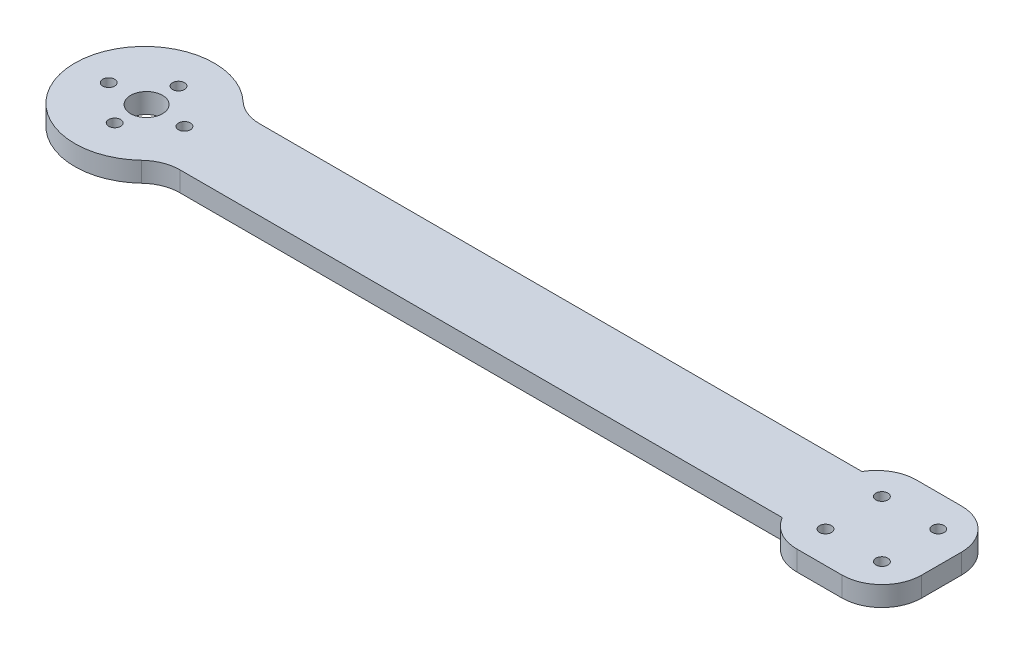
ISO-10303-21;
HEADER;
FILE_DESCRIPTION(('STEP AP214'),'2;1');
FILE_NAME('part.step','',(''),(''),'','','');
FILE_SCHEMA(('AUTOMOTIVE_DESIGN { 1 0 10303 214 1 1 1 1 }'));
ENDSEC;
DATA;
#1=APPLICATION_CONTEXT('core data for automotive mechanical design processes');
#2=APPLICATION_PROTOCOL_DEFINITION('international standard','automotive_design',2000,#1);
#3=PRODUCT_CONTEXT('',#1,'mechanical');
#4=PRODUCT('Part','Part','',(#3));
#5=PRODUCT_RELATED_PRODUCT_CATEGORY('part','',(#4));
#6=PRODUCT_DEFINITION_FORMATION('','',#4);
#7=PRODUCT_DEFINITION_CONTEXT('part definition',#1,'design');
#8=PRODUCT_DEFINITION('design','',#6,#7);
#9=PRODUCT_DEFINITION_SHAPE('','',#8);
#10=(LENGTH_UNIT() NAMED_UNIT(*) SI_UNIT(.MILLI.,.METRE.));
#11=(NAMED_UNIT(*) PLANE_ANGLE_UNIT() SI_UNIT($,.RADIAN.));
#12=(NAMED_UNIT(*) SI_UNIT($,.STERADIAN.) SOLID_ANGLE_UNIT());
#13=UNCERTAINTY_MEASURE_WITH_UNIT(LENGTH_MEASURE(1.E-05),#10,'distance_accuracy_value','');
#14=(GEOMETRIC_REPRESENTATION_CONTEXT(3) GLOBAL_UNCERTAINTY_ASSIGNED_CONTEXT((#13)) GLOBAL_UNIT_ASSIGNED_CONTEXT((#10,
#11,#12)) REPRESENTATION_CONTEXT('',''));
#15=CARTESIAN_POINT('',(0.,0.,0.));
#16=DIRECTION('',(0.,0.,1.));
#17=DIRECTION('',(1.,0.,0.));
#18=AXIS2_PLACEMENT_3D('',#15,#16,#17);
#19=CARTESIAN_POINT('',(-100.,5.,0.));
#20=DIRECTION('',(0.,-1.,0.));
#21=DIRECTION('',(0.,0.,-1.));
#22=AXIS2_PLACEMENT_3D('',#19,#20,#21);
#23=CYLINDRICAL_SURFACE('',#22,17.5);
#24=CARTESIAN_POINT('',(-100.,5.,0.));
#25=DIRECTION('',(0.,1.,0.));
#26=DIRECTION('',(0.,0.,1.));
#27=AXIS2_PLACEMENT_3D('',#24,#25,#26);
#28=CIRCLE('',#27,17.5);
#29=CARTESIAN_POINT('',(-87.9888997620693,5.,-12.7272727272727));
#30=VERTEX_POINT('',#29);
#31=CARTESIAN_POINT('',(-87.9888997620693,5.,12.7272727272727));
#32=VERTEX_POINT('',#31);
#33=EDGE_CURVE('E132',#30,#32,#28,.T.);
#34=ORIENTED_EDGE('',*,*,#33,.F.);
#35=DIRECTION('',(0.,-1.,0.));
#36=VECTOR('',#35,1.);
#37=CARTESIAN_POINT('',(-87.9888997620693,5.,-12.7272727272727));
#38=LINE('',#37,#36);
#39=CARTESIAN_POINT('',(-87.9888997620693,0.,-12.7272727272727));
#40=VERTEX_POINT('',#39);
#41=EDGE_CURVE('E166',#30,#40,#38,.T.);
#42=ORIENTED_EDGE('',*,*,#41,.T.);
#43=CARTESIAN_POINT('',(-100.,0.,0.));
#44=DIRECTION('',(0.,1.,0.));
#45=DIRECTION('',(0.,0.,1.));
#46=AXIS2_PLACEMENT_3D('',#43,#44,#45);
#47=CIRCLE('',#46,17.5);
#48=CARTESIAN_POINT('',(-87.9888997620693,0.,12.7272727272727));
#49=VERTEX_POINT('',#48);
#50=EDGE_CURVE('E181',#40,#49,#47,.T.);
#51=ORIENTED_EDGE('',*,*,#50,.T.);
#52=DIRECTION('',(0.,-1.,0.));
#53=VECTOR('',#52,1.);
#54=CARTESIAN_POINT('',(-87.9888997620693,5.,12.7272727272727));
#55=LINE('',#54,#53);
#56=EDGE_CURVE('E164',#49,#32,#55,.F.);
#57=ORIENTED_EDGE('',*,*,#56,.T.);
#58=EDGE_LOOP('',(#34,#42,#51,#57));
#59=FACE_BOUND('',#58,.T.);
#60=ADVANCED_FACE('F38',(#59),#23,.T.);
#61=CARTESIAN_POINT('',(0.,5.,10.));
#62=DIRECTION('',(0.,0.,-1.));
#63=DIRECTION('',(-1.,0.,0.));
#64=AXIS2_PLACEMENT_3D('',#61,#62,#63);
#65=PLANE('',#64);
#66=DIRECTION('',(1.,0.,0.));
#67=VECTOR('',#66,1.);
#68=CARTESIAN_POINT('',(0.,5.,10.));
#69=LINE('',#68,#67);
#70=CARTESIAN_POINT('',(-81.1254139118231,5.,10.));
#71=VERTEX_POINT('',#70);
#72=CARTESIAN_POINT('',(70.,5.,10.));
#73=VERTEX_POINT('',#72);
#74=EDGE_CURVE('E123',#71,#73,#69,.T.);
#75=ORIENTED_EDGE('',*,*,#74,.F.);
#76=DIRECTION('',(0.,1.,0.));
#77=VECTOR('',#76,1.);
#78=CARTESIAN_POINT('',(-81.1254139118231,0.,10.));
#79=LINE('',#78,#77);
#80=CARTESIAN_POINT('',(-81.1254139118231,0.,10.));
#81=VERTEX_POINT('',#80);
#82=EDGE_CURVE('E171',#71,#81,#79,.F.);
#83=ORIENTED_EDGE('',*,*,#82,.T.);
#84=DIRECTION('',(1.,0.,0.));
#85=VECTOR('',#84,1.);
#86=CARTESIAN_POINT('',(0.,0.,10.));
#87=LINE('',#86,#85);
#88=CARTESIAN_POINT('',(70.,0.,10.));
#89=VERTEX_POINT('',#88);
#90=EDGE_CURVE('E138',#81,#89,#87,.T.);
#91=ORIENTED_EDGE('',*,*,#90,.T.);
#92=DIRECTION('',(0.,-1.,0.));
#93=VECTOR('',#92,1.);
#94=CARTESIAN_POINT('',(70.,5.,10.));
#95=LINE('',#94,#93);
#96=EDGE_CURVE('E135',#73,#89,#95,.T.);
#97=ORIENTED_EDGE('',*,*,#96,.F.);
#98=EDGE_LOOP('',(#75,#83,#91,#97));
#99=FACE_BOUND('',#98,.T.);
#100=ADVANCED_FACE('F136',(#99),#65,.F.);
#101=CARTESIAN_POINT('',(0.,5.,15.));
#102=DIRECTION('',(0.,0.,-1.));
#103=DIRECTION('',(-1.,0.,0.));
#104=AXIS2_PLACEMENT_3D('',#101,#102,#103);
#105=PLANE('',#104);
#106=DIRECTION('',(1.,0.,0.));
#107=VECTOR('',#106,1.);
#108=CARTESIAN_POINT('',(0.,5.,15.));
#109=LINE('',#108,#107);
#110=CARTESIAN_POINT('',(78.6602540378444,5.,15.));
#111=VERTEX_POINT('',#110);
#112=CARTESIAN_POINT('',(90.,5.,15.));
#113=VERTEX_POINT('',#112);
#114=EDGE_CURVE('E131',#111,#113,#109,.T.);
#115=ORIENTED_EDGE('',*,*,#114,.F.);
#116=DIRECTION('',(0.,1.,0.));
#117=VECTOR('',#116,1.);
#118=CARTESIAN_POINT('',(78.6602540378444,5.,15.));
#119=LINE('',#118,#117);
#120=CARTESIAN_POINT('',(78.6602540378444,0.,15.));
#121=VERTEX_POINT('',#120);
#122=EDGE_CURVE('E147',#111,#121,#119,.F.);
#123=ORIENTED_EDGE('',*,*,#122,.T.);
#124=DIRECTION('',(1.,0.,0.));
#125=VECTOR('',#124,1.);
#126=CARTESIAN_POINT('',(0.,0.,15.));
#127=LINE('',#126,#125);
#128=CARTESIAN_POINT('',(90.,0.,15.));
#129=VERTEX_POINT('',#128);
#130=EDGE_CURVE('E249',#121,#129,#127,.T.);
#131=ORIENTED_EDGE('',*,*,#130,.T.);
#132=DIRECTION('',(0.,-1.,0.));
#133=VECTOR('',#132,1.);
#134=CARTESIAN_POINT('',(90.,5.,15.));
#135=LINE('',#134,#133);
#136=EDGE_CURVE('E141',#129,#113,#135,.F.);
#137=ORIENTED_EDGE('',*,*,#136,.T.);
#138=EDGE_LOOP('',(#115,#123,#131,#137));
#139=FACE_BOUND('',#138,.T.);
#140=ADVANCED_FACE('F199',(#139),#105,.F.);
#141=CARTESIAN_POINT('',(100.,5.,0.));
#142=DIRECTION('',(1.,0.,0.));
#143=DIRECTION('',(0.,0.,-1.));
#144=AXIS2_PLACEMENT_3D('',#141,#142,#143);
#145=PLANE('',#144);
#146=DIRECTION('',(0.,0.,1.));
#147=VECTOR('',#146,1.);
#148=CARTESIAN_POINT('',(100.,5.,0.));
#149=LINE('',#148,#147);
#150=CARTESIAN_POINT('',(100.,5.,-5.));
#151=VERTEX_POINT('',#150);
#152=CARTESIAN_POINT('',(100.,5.,4.99999999999999));
#153=VERTEX_POINT('',#152);
#154=EDGE_CURVE('E257',#151,#153,#149,.T.);
#155=ORIENTED_EDGE('',*,*,#154,.T.);
#156=DIRECTION('',(0.,-1.,0.));
#157=VECTOR('',#156,1.);
#158=CARTESIAN_POINT('',(100.,0.,4.99999999999999));
#159=LINE('',#158,#157);
#160=CARTESIAN_POINT('',(100.,0.,4.99999999999999));
#161=VERTEX_POINT('',#160);
#162=EDGE_CURVE('E151',#153,#161,#159,.T.);
#163=ORIENTED_EDGE('',*,*,#162,.T.);
#164=DIRECTION('',(0.,0.,1.));
#165=VECTOR('',#164,1.);
#166=CARTESIAN_POINT('',(100.,0.,0.));
#167=LINE('',#166,#165);
#168=CARTESIAN_POINT('',(100.,0.,-5.));
#169=VERTEX_POINT('',#168);
#170=EDGE_CURVE('E246',#169,#161,#167,.T.);
#171=ORIENTED_EDGE('',*,*,#170,.F.);
#172=DIRECTION('',(0.,-1.,0.));
#173=VECTOR('',#172,1.);
#174=CARTESIAN_POINT('',(100.,5.,-5.));
#175=LINE('',#174,#173);
#176=EDGE_CURVE('E148',#169,#151,#175,.F.);
#177=ORIENTED_EDGE('',*,*,#176,.T.);
#178=EDGE_LOOP('',(#155,#163,#171,#177));
#179=FACE_BOUND('',#178,.T.);
#180=ADVANCED_FACE('F368',(#179),#145,.T.);
#181=CARTESIAN_POINT('',(0.,5.,-15.));
#182=DIRECTION('',(0.,0.,-1.));
#183=DIRECTION('',(-1.,0.,0.));
#184=AXIS2_PLACEMENT_3D('',#181,#182,#183);
#185=PLANE('',#184);
#186=DIRECTION('',(1.,0.,0.));
#187=VECTOR('',#186,1.);
#188=CARTESIAN_POINT('',(0.,5.,-15.));
#189=LINE('',#188,#187);
#190=CARTESIAN_POINT('',(78.6602540378444,5.,-15.));
#191=VERTEX_POINT('',#190);
#192=CARTESIAN_POINT('',(90.,5.,-15.));
#193=VERTEX_POINT('',#192);
#194=EDGE_CURVE('E254',#191,#193,#189,.T.);
#195=ORIENTED_EDGE('',*,*,#194,.T.);
#196=DIRECTION('',(0.,-1.,0.));
#197=VECTOR('',#196,1.);
#198=CARTESIAN_POINT('',(90.,5.,-15.));
#199=LINE('',#198,#197);
#200=CARTESIAN_POINT('',(90.,0.,-15.));
#201=VERTEX_POINT('',#200);
#202=EDGE_CURVE('E161',#193,#201,#199,.T.);
#203=ORIENTED_EDGE('',*,*,#202,.T.);
#204=DIRECTION('',(1.,0.,0.));
#205=VECTOR('',#204,1.);
#206=CARTESIAN_POINT('',(0.,0.,-15.));
#207=LINE('',#206,#205);
#208=CARTESIAN_POINT('',(78.6602540378444,0.,-15.));
#209=VERTEX_POINT('',#208);
#210=EDGE_CURVE('E243',#209,#201,#207,.T.);
#211=ORIENTED_EDGE('',*,*,#210,.F.);
#212=DIRECTION('',(0.,-1.,0.));
#213=VECTOR('',#212,1.);
#214=CARTESIAN_POINT('',(78.6602540378444,5.,-15.));
#215=LINE('',#214,#213);
#216=EDGE_CURVE('E159',#209,#191,#215,.F.);
#217=ORIENTED_EDGE('',*,*,#216,.T.);
#218=EDGE_LOOP('',(#195,#203,#211,#217));
#219=FACE_BOUND('',#218,.T.);
#220=ADVANCED_FACE('F364',(#219),#185,.T.);
#221=CARTESIAN_POINT('',(0.,5.,-10.));
#222=DIRECTION('',(0.,0.,-1.));
#223=DIRECTION('',(-1.,0.,0.));
#224=AXIS2_PLACEMENT_3D('',#221,#222,#223);
#225=PLANE('',#224);
#226=DIRECTION('',(1.,0.,0.));
#227=VECTOR('',#226,1.);
#228=CARTESIAN_POINT('',(0.,0.,-10.));
#229=LINE('',#228,#227);
#230=CARTESIAN_POINT('',(-81.1254139118231,0.,-10.));
#231=VERTEX_POINT('',#230);
#232=CARTESIAN_POINT('',(70.,0.,-10.));
#233=VERTEX_POINT('',#232);
#234=EDGE_CURVE('E241',#231,#233,#229,.T.);
#235=ORIENTED_EDGE('',*,*,#234,.F.);
#236=DIRECTION('',(0.,-1.,0.));
#237=VECTOR('',#236,1.);
#238=CARTESIAN_POINT('',(-81.1254139118231,5.,-10.));
#239=LINE('',#238,#237);
#240=CARTESIAN_POINT('',(-81.1254139118231,5.,-10.));
#241=VERTEX_POINT('',#240);
#242=EDGE_CURVE('E169',#231,#241,#239,.F.);
#243=ORIENTED_EDGE('',*,*,#242,.T.);
#244=DIRECTION('',(1.,0.,0.));
#245=VECTOR('',#244,1.);
#246=CARTESIAN_POINT('',(0.,5.,-10.));
#247=LINE('',#246,#245);
#248=CARTESIAN_POINT('',(70.,5.,-10.));
#249=VERTEX_POINT('',#248);
#250=EDGE_CURVE('E240',#241,#249,#247,.T.);
#251=ORIENTED_EDGE('',*,*,#250,.T.);
#252=DIRECTION('',(0.,-1.,0.));
#253=VECTOR('',#252,1.);
#254=CARTESIAN_POINT('',(70.,5.,-10.));
#255=LINE('',#254,#253);
#256=EDGE_CURVE('E142',#249,#233,#255,.T.);
#257=ORIENTED_EDGE('',*,*,#256,.T.);
#258=EDGE_LOOP('',(#235,#243,#251,#257));
#259=FACE_BOUND('',#258,.T.);
#260=ADVANCED_FACE('F328',(#259),#225,.T.);
#261=CARTESIAN_POINT('',(0.,5.,0.));
#262=DIRECTION('',(0.,1.,0.));
#263=DIRECTION('',(0.,0.,1.));
#264=AXIS2_PLACEMENT_3D('',#261,#262,#263);
#265=PLANE('',#264);
#266=CARTESIAN_POINT('',(77.9289321881347,5.,7.07106781186542));
#267=DIRECTION('',(0.,1.,0.));
#268=DIRECTION('',(0.,0.,1.));
#269=AXIS2_PLACEMENT_3D('',#266,#267,#268);
#270=CIRCLE('',#269,1.50000000000001);
#271=CARTESIAN_POINT('',(77.9289321881347,5.,8.57106781186543));
#272=VERTEX_POINT('',#271);
#273=EDGE_CURVE('E298',#272,#272,#270,.T.);
#274=ORIENTED_EDGE('',*,*,#273,.F.);
#275=EDGE_LOOP('',(#274));
#276=FACE_BOUND('',#275,.T.);
#277=CARTESIAN_POINT('',(92.0710678118656,5.,7.07106781186531));
#278=DIRECTION('',(0.,1.,0.));
#279=DIRECTION('',(0.,0.,1.));
#280=AXIS2_PLACEMENT_3D('',#277,#278,#279);
#281=CIRCLE('',#280,1.49999999999999);
#282=CARTESIAN_POINT('',(92.0710678118656,5.,8.5710678118653));
#283=VERTEX_POINT('',#282);
#284=EDGE_CURVE('E304',#283,#283,#281,.T.);
#285=ORIENTED_EDGE('',*,*,#284,.F.);
#286=EDGE_LOOP('',(#285));
#287=FACE_BOUND('',#286,.T.);
#288=CARTESIAN_POINT('',(92.0710678118655,5.,-7.07106781186567));
#289=DIRECTION('',(0.,1.,0.));
#290=DIRECTION('',(0.,0.,1.));
#291=AXIS2_PLACEMENT_3D('',#288,#289,#290);
#292=CIRCLE('',#291,1.5);
#293=CARTESIAN_POINT('',(92.0710678118655,5.,-5.57106781186567));
#294=VERTEX_POINT('',#293);
#295=EDGE_CURVE('E310',#294,#294,#292,.T.);
#296=ORIENTED_EDGE('',*,*,#295,.F.);
#297=EDGE_LOOP('',(#296));
#298=FACE_BOUND('',#297,.T.);
#299=CARTESIAN_POINT('',(77.9289321881345,5.,-7.07106781186548));
#300=DIRECTION('',(0.,1.,0.));
#301=DIRECTION('',(0.,0.,1.));
#302=AXIS2_PLACEMENT_3D('',#299,#300,#301);
#303=CIRCLE('',#302,1.5);
#304=CARTESIAN_POINT('',(77.9289321881345,5.,-5.57106781186548));
#305=VERTEX_POINT('',#304);
#306=EDGE_CURVE('E292',#305,#305,#303,.T.);
#307=ORIENTED_EDGE('',*,*,#306,.F.);
#308=EDGE_LOOP('',(#307));
#309=FACE_BOUND('',#308,.T.);
#310=CARTESIAN_POINT('',(-99.4855813511007,5.,-8.));
#311=DIRECTION('',(0.,1.,0.));
#312=DIRECTION('',(0.,0.,1.));
#313=AXIS2_PLACEMENT_3D('',#310,#311,#312);
#314=CIRCLE('',#313,1.5);
#315=CARTESIAN_POINT('',(-99.4855813511007,5.,-6.5));
#316=VERTEX_POINT('',#315);
#317=EDGE_CURVE('E275',#316,#316,#314,.T.);
#318=ORIENTED_EDGE('',*,*,#317,.F.);
#319=EDGE_LOOP('',(#318));
#320=FACE_BOUND('',#319,.T.);
#321=CARTESIAN_POINT('',(-99.4855813511007,5.,8.));
#322=DIRECTION('',(0.,1.,0.));
#323=DIRECTION('',(0.,0.,1.));
#324=AXIS2_PLACEMENT_3D('',#321,#322,#323);
#325=CIRCLE('',#324,1.5);
#326=CARTESIAN_POINT('',(-99.4855813511007,5.,9.5));
#327=VERTEX_POINT('',#326);
#328=EDGE_CURVE('E268',#327,#327,#325,.T.);
#329=ORIENTED_EDGE('',*,*,#328,.F.);
#330=EDGE_LOOP('',(#329));
#331=FACE_BOUND('',#330,.T.);
#332=CARTESIAN_POINT('',(-108.985581351101,5.,0.));
#333=DIRECTION('',(0.,1.,0.));
#334=DIRECTION('',(0.,0.,1.));
#335=AXIS2_PLACEMENT_3D('',#332,#333,#334);
#336=CIRCLE('',#335,1.5);
#337=CARTESIAN_POINT('',(-108.985581351101,5.,1.5));
#338=VERTEX_POINT('',#337);
#339=EDGE_CURVE('E287',#338,#338,#336,.T.);
#340=ORIENTED_EDGE('',*,*,#339,.F.);
#341=EDGE_LOOP('',(#340));
#342=FACE_BOUND('',#341,.T.);
#343=CARTESIAN_POINT('',(-89.9855813511007,5.,0.));
#344=DIRECTION('',(0.,1.,0.));
#345=DIRECTION('',(0.,0.,1.));
#346=AXIS2_PLACEMENT_3D('',#343,#344,#345);
#347=CIRCLE('',#346,1.5);
#348=CARTESIAN_POINT('',(-89.9855813511007,5.,1.5));
#349=VERTEX_POINT('',#348);
#350=EDGE_CURVE('E280',#349,#349,#347,.T.);
#351=ORIENTED_EDGE('',*,*,#350,.F.);
#352=EDGE_LOOP('',(#351));
#353=FACE_BOUND('',#352,.T.);
#354=CARTESIAN_POINT('',(-99.4855813511007,5.,0.));
#355=DIRECTION('',(0.,1.,0.));
#356=DIRECTION('',(0.,0.,1.));
#357=AXIS2_PLACEMENT_3D('',#354,#355,#356);
#358=CIRCLE('',#357,4.00000000000001);
#359=CARTESIAN_POINT('',(-99.4855813511007,5.,4.00000000000001));
#360=VERTEX_POINT('',#359);
#361=EDGE_CURVE('E262',#360,#360,#358,.T.);
#362=ORIENTED_EDGE('',*,*,#361,.F.);
#363=EDGE_LOOP('',(#362));
#364=FACE_BOUND('',#363,.T.);
#365=ORIENTED_EDGE('',*,*,#33,.T.);
#366=CARTESIAN_POINT('',(-81.1254139118231,5.,20.));
#367=DIRECTION('',(0.,1.,0.));
#368=DIRECTION('',(0.,0.,1.));
#369=AXIS2_PLACEMENT_3D('',#366,#367,#368);
#370=CIRCLE('',#369,10.);
#371=EDGE_CURVE('E11',#32,#71,#370,.F.);
#372=ORIENTED_EDGE('',*,*,#371,.T.);
#373=ORIENTED_EDGE('',*,*,#74,.T.);
#374=CARTESIAN_POINT('',(78.6602540378444,5.,4.99999999999999));
#375=DIRECTION('',(0.,1.,0.));
#376=DIRECTION('',(0.,0.,1.));
#377=AXIS2_PLACEMENT_3D('',#374,#375,#376);
#378=CIRCLE('',#377,10.);
#379=EDGE_CURVE('E128',#73,#111,#378,.T.);
#380=ORIENTED_EDGE('',*,*,#379,.T.);
#381=ORIENTED_EDGE('',*,*,#114,.T.);
#382=CARTESIAN_POINT('',(90.,5.,4.99999999999999));
#383=DIRECTION('',(0.,1.,0.));
#384=DIRECTION('',(0.,0.,1.));
#385=AXIS2_PLACEMENT_3D('',#382,#383,#384);
#386=CIRCLE('',#385,10.);
#387=EDGE_CURVE('E149',#113,#153,#386,.T.);
#388=ORIENTED_EDGE('',*,*,#387,.T.);
#389=ORIENTED_EDGE('',*,*,#154,.F.);
#390=CARTESIAN_POINT('',(90.,5.,-5.00000000000001));
#391=DIRECTION('',(0.,1.,0.));
#392=DIRECTION('',(0.,0.,1.));
#393=AXIS2_PLACEMENT_3D('',#390,#391,#392);
#394=CIRCLE('',#393,10.);
#395=EDGE_CURVE('E153',#151,#193,#394,.T.);
#396=ORIENTED_EDGE('',*,*,#395,.T.);
#397=ORIENTED_EDGE('',*,*,#194,.F.);
#398=CARTESIAN_POINT('',(78.6602540378444,5.,-5.00000000000001));
#399=DIRECTION('',(0.,1.,0.));
#400=DIRECTION('',(0.,0.,1.));
#401=AXIS2_PLACEMENT_3D('',#398,#399,#400);
#402=CIRCLE('',#401,10.);
#403=EDGE_CURVE('E222',#191,#249,#402,.T.);
#404=ORIENTED_EDGE('',*,*,#403,.T.);
#405=ORIENTED_EDGE('',*,*,#250,.F.);
#406=CARTESIAN_POINT('',(-81.1254139118231,5.,-20.));
#407=DIRECTION('',(0.,1.,0.));
#408=DIRECTION('',(0.,0.,1.));
#409=AXIS2_PLACEMENT_3D('',#406,#407,#408);
#410=CIRCLE('',#409,10.);
#411=EDGE_CURVE('E175',#241,#30,#410,.F.);
#412=ORIENTED_EDGE('',*,*,#411,.T.);
#413=EDGE_LOOP('',(#365,#372,#373,#380,#381,#388,#389,#396,#397,#404,#405,#412));
#414=FACE_BOUND('',#413,.T.);
#415=ADVANCED_FACE('F125',(#276,#287,#298,#309,#320,#331,#342,#353,#364,#414),#265,.T.);
#416=CARTESIAN_POINT('',(0.,0.,0.));
#417=DIRECTION('',(0.,1.,0.));
#418=DIRECTION('',(0.,0.,1.));
#419=AXIS2_PLACEMENT_3D('',#416,#417,#418);
#420=PLANE('',#419);
#421=CARTESIAN_POINT('',(77.9289321881347,0.,7.07106781186542));
#422=DIRECTION('',(0.,1.,0.));
#423=DIRECTION('',(0.,0.,1.));
#424=AXIS2_PLACEMENT_3D('',#421,#422,#423);
#425=CIRCLE('',#424,1.50000000000001);
#426=CARTESIAN_POINT('',(77.9289321881347,0.,8.57106781186543));
#427=VERTEX_POINT('',#426);
#428=EDGE_CURVE('E301',#427,#427,#425,.T.);
#429=ORIENTED_EDGE('',*,*,#428,.T.);
#430=EDGE_LOOP('',(#429));
#431=FACE_BOUND('',#430,.T.);
#432=CARTESIAN_POINT('',(92.0710678118656,0.,7.07106781186531));
#433=DIRECTION('',(0.,1.,0.));
#434=DIRECTION('',(0.,0.,1.));
#435=AXIS2_PLACEMENT_3D('',#432,#433,#434);
#436=CIRCLE('',#435,1.49999999999999);
#437=CARTESIAN_POINT('',(92.0710678118656,0.,8.5710678118653));
#438=VERTEX_POINT('',#437);
#439=EDGE_CURVE('E307',#438,#438,#436,.T.);
#440=ORIENTED_EDGE('',*,*,#439,.T.);
#441=EDGE_LOOP('',(#440));
#442=FACE_BOUND('',#441,.T.);
#443=CARTESIAN_POINT('',(92.0710678118655,0.,-7.07106781186567));
#444=DIRECTION('',(0.,1.,0.));
#445=DIRECTION('',(0.,0.,1.));
#446=AXIS2_PLACEMENT_3D('',#443,#444,#445);
#447=CIRCLE('',#446,1.5);
#448=CARTESIAN_POINT('',(92.0710678118655,0.,-5.57106781186567));
#449=VERTEX_POINT('',#448);
#450=EDGE_CURVE('E295',#449,#449,#447,.T.);
#451=ORIENTED_EDGE('',*,*,#450,.T.);
#452=EDGE_LOOP('',(#451));
#453=FACE_BOUND('',#452,.T.);
#454=CARTESIAN_POINT('',(77.9289321881345,0.,-7.07106781186548));
#455=DIRECTION('',(0.,1.,0.));
#456=DIRECTION('',(0.,0.,1.));
#457=AXIS2_PLACEMENT_3D('',#454,#455,#456);
#458=CIRCLE('',#457,1.5);
#459=CARTESIAN_POINT('',(77.9289321881345,0.,-5.57106781186548));
#460=VERTEX_POINT('',#459);
#461=EDGE_CURVE('E284',#460,#460,#458,.T.);
#462=ORIENTED_EDGE('',*,*,#461,.T.);
#463=EDGE_LOOP('',(#462));
#464=FACE_BOUND('',#463,.T.);
#465=CARTESIAN_POINT('',(-99.4855813511007,0.,-8.));
#466=DIRECTION('',(0.,1.,0.));
#467=DIRECTION('',(0.,0.,1.));
#468=AXIS2_PLACEMENT_3D('',#465,#466,#467);
#469=CIRCLE('',#468,1.5);
#470=CARTESIAN_POINT('',(-99.4855813511007,0.,-6.5));
#471=VERTEX_POINT('',#470);
#472=EDGE_CURVE('E265',#471,#471,#469,.T.);
#473=ORIENTED_EDGE('',*,*,#472,.T.);
#474=EDGE_LOOP('',(#473));
#475=FACE_BOUND('',#474,.T.);
#476=CARTESIAN_POINT('',(-99.4855813511007,0.,8.));
#477=DIRECTION('',(0.,1.,0.));
#478=DIRECTION('',(0.,0.,1.));
#479=AXIS2_PLACEMENT_3D('',#476,#477,#478);
#480=CIRCLE('',#479,1.5);
#481=CARTESIAN_POINT('',(-99.4855813511007,0.,9.5));
#482=VERTEX_POINT('',#481);
#483=EDGE_CURVE('E271',#482,#482,#480,.T.);
#484=ORIENTED_EDGE('',*,*,#483,.T.);
#485=EDGE_LOOP('',(#484));
#486=FACE_BOUND('',#485,.T.);
#487=CARTESIAN_POINT('',(-108.985581351101,0.,0.));
#488=DIRECTION('',(0.,1.,0.));
#489=DIRECTION('',(0.,0.,1.));
#490=AXIS2_PLACEMENT_3D('',#487,#488,#489);
#491=CIRCLE('',#490,1.5);
#492=CARTESIAN_POINT('',(-108.985581351101,0.,1.5));
#493=VERTEX_POINT('',#492);
#494=EDGE_CURVE('E272',#493,#493,#491,.T.);
#495=ORIENTED_EDGE('',*,*,#494,.T.);
#496=EDGE_LOOP('',(#495));
#497=FACE_BOUND('',#496,.T.);
#498=CARTESIAN_POINT('',(-89.9855813511007,0.,0.));
#499=DIRECTION('',(0.,1.,0.));
#500=DIRECTION('',(0.,0.,1.));
#501=AXIS2_PLACEMENT_3D('',#498,#499,#500);
#502=CIRCLE('',#501,1.5);
#503=CARTESIAN_POINT('',(-89.9855813511007,0.,1.5));
#504=VERTEX_POINT('',#503);
#505=EDGE_CURVE('E283',#504,#504,#502,.T.);
#506=ORIENTED_EDGE('',*,*,#505,.T.);
#507=EDGE_LOOP('',(#506));
#508=FACE_BOUND('',#507,.T.);
#509=CARTESIAN_POINT('',(-99.4855813511007,0.,0.));
#510=DIRECTION('',(0.,1.,0.));
#511=DIRECTION('',(0.,0.,1.));
#512=AXIS2_PLACEMENT_3D('',#509,#510,#511);
#513=CIRCLE('',#512,4.00000000000001);
#514=CARTESIAN_POINT('',(-99.4855813511007,0.,4.00000000000001));
#515=VERTEX_POINT('',#514);
#516=EDGE_CURVE('E185',#515,#515,#513,.T.);
#517=ORIENTED_EDGE('',*,*,#516,.T.);
#518=EDGE_LOOP('',(#517));
#519=FACE_BOUND('',#518,.T.);
#520=ORIENTED_EDGE('',*,*,#130,.F.);
#521=CARTESIAN_POINT('',(78.6602540378444,0.,4.99999999999999));
#522=DIRECTION('',(0.,1.,0.));
#523=DIRECTION('',(0.,0.,1.));
#524=AXIS2_PLACEMENT_3D('',#521,#522,#523);
#525=CIRCLE('',#524,10.);
#526=EDGE_CURVE('E227',#121,#89,#525,.F.);
#527=ORIENTED_EDGE('',*,*,#526,.T.);
#528=ORIENTED_EDGE('',*,*,#90,.F.);
#529=CARTESIAN_POINT('',(-81.1254139118231,0.,20.));
#530=DIRECTION('',(0.,1.,0.));
#531=DIRECTION('',(0.,0.,1.));
#532=AXIS2_PLACEMENT_3D('',#529,#530,#531);
#533=CIRCLE('',#532,10.);
#534=EDGE_CURVE('E46',#81,#49,#533,.T.);
#535=ORIENTED_EDGE('',*,*,#534,.T.);
#536=ORIENTED_EDGE('',*,*,#50,.F.);
#537=CARTESIAN_POINT('',(-81.1254139118231,0.,-20.));
#538=DIRECTION('',(0.,1.,0.));
#539=DIRECTION('',(0.,0.,1.));
#540=AXIS2_PLACEMENT_3D('',#537,#538,#539);
#541=CIRCLE('',#540,10.);
#542=EDGE_CURVE('E173',#40,#231,#541,.T.);
#543=ORIENTED_EDGE('',*,*,#542,.T.);
#544=ORIENTED_EDGE('',*,*,#234,.T.);
#545=CARTESIAN_POINT('',(78.6602540378444,0.,-5.00000000000001));
#546=DIRECTION('',(0.,1.,0.));
#547=DIRECTION('',(0.,0.,1.));
#548=AXIS2_PLACEMENT_3D('',#545,#546,#547);
#549=CIRCLE('',#548,10.);
#550=EDGE_CURVE('E235',#233,#209,#549,.F.);
#551=ORIENTED_EDGE('',*,*,#550,.T.);
#552=ORIENTED_EDGE('',*,*,#210,.T.);
#553=CARTESIAN_POINT('',(90.,0.,-5.00000000000001));
#554=DIRECTION('',(0.,1.,0.));
#555=DIRECTION('',(0.,0.,1.));
#556=AXIS2_PLACEMENT_3D('',#553,#554,#555);
#557=CIRCLE('',#556,10.);
#558=EDGE_CURVE('E233',#201,#169,#557,.F.);
#559=ORIENTED_EDGE('',*,*,#558,.T.);
#560=ORIENTED_EDGE('',*,*,#170,.T.);
#561=CARTESIAN_POINT('',(90.,0.,4.99999999999999));
#562=DIRECTION('',(0.,1.,0.));
#563=DIRECTION('',(0.,0.,1.));
#564=AXIS2_PLACEMENT_3D('',#561,#562,#563);
#565=CIRCLE('',#564,10.);
#566=EDGE_CURVE('E229',#161,#129,#565,.F.);
#567=ORIENTED_EDGE('',*,*,#566,.T.);
#568=EDGE_LOOP('',(#520,#527,#528,#535,#536,#543,#544,#551,#552,#559,#560,#567));
#569=FACE_BOUND('',#568,.T.);
#570=ADVANCED_FACE('F180',(#431,#442,#453,#464,#475,#486,#497,#508,#519,#569),#420,.F.);
#571=CARTESIAN_POINT('',(-99.4855813511007,0.,0.));
#572=DIRECTION('',(0.,1.,0.));
#573=DIRECTION('',(0.,0.,1.));
#574=AXIS2_PLACEMENT_3D('',#571,#572,#573);
#575=CYLINDRICAL_SURFACE('',#574,4.00000000000001);
#576=ORIENTED_EDGE('',*,*,#516,.F.);
#577=EDGE_LOOP('',(#576));
#578=FACE_BOUND('',#577,.T.);
#579=ORIENTED_EDGE('',*,*,#361,.T.);
#580=EDGE_LOOP('',(#579));
#581=FACE_BOUND('',#580,.T.);
#582=ADVANCED_FACE('F343',(#578,#581),#575,.F.);
#583=CARTESIAN_POINT('',(-89.9855813511007,0.,0.));
#584=DIRECTION('',(0.,1.,0.));
#585=DIRECTION('',(0.,0.,1.));
#586=AXIS2_PLACEMENT_3D('',#583,#584,#585);
#587=CYLINDRICAL_SURFACE('',#586,1.5);
#588=ORIENTED_EDGE('',*,*,#505,.F.);
#589=EDGE_LOOP('',(#588));
#590=FACE_BOUND('',#589,.T.);
#591=ORIENTED_EDGE('',*,*,#350,.T.);
#592=EDGE_LOOP('',(#591));
#593=FACE_BOUND('',#592,.T.);
#594=ADVANCED_FACE('F345',(#590,#593),#587,.F.);
#595=CARTESIAN_POINT('',(-108.985581351101,0.,0.));
#596=DIRECTION('',(0.,1.,0.));
#597=DIRECTION('',(0.,0.,1.));
#598=AXIS2_PLACEMENT_3D('',#595,#596,#597);
#599=CYLINDRICAL_SURFACE('',#598,1.5);
#600=ORIENTED_EDGE('',*,*,#494,.F.);
#601=EDGE_LOOP('',(#600));
#602=FACE_BOUND('',#601,.T.);
#603=ORIENTED_EDGE('',*,*,#339,.T.);
#604=EDGE_LOOP('',(#603));
#605=FACE_BOUND('',#604,.T.);
#606=ADVANCED_FACE('F352',(#602,#605),#599,.F.);
#607=CARTESIAN_POINT('',(-99.4855813511007,0.,8.));
#608=DIRECTION('',(0.,1.,0.));
#609=DIRECTION('',(0.,0.,1.));
#610=AXIS2_PLACEMENT_3D('',#607,#608,#609);
#611=CYLINDRICAL_SURFACE('',#610,1.5);
#612=ORIENTED_EDGE('',*,*,#483,.F.);
#613=EDGE_LOOP('',(#612));
#614=FACE_BOUND('',#613,.T.);
#615=ORIENTED_EDGE('',*,*,#328,.T.);
#616=EDGE_LOOP('',(#615));
#617=FACE_BOUND('',#616,.T.);
#618=ADVANCED_FACE('F359',(#614,#617),#611,.F.);
#619=CARTESIAN_POINT('',(-99.4855813511007,0.,-8.));
#620=DIRECTION('',(0.,1.,0.));
#621=DIRECTION('',(0.,0.,1.));
#622=AXIS2_PLACEMENT_3D('',#619,#620,#621);
#623=CYLINDRICAL_SURFACE('',#622,1.5);
#624=ORIENTED_EDGE('',*,*,#472,.F.);
#625=EDGE_LOOP('',(#624));
#626=FACE_BOUND('',#625,.T.);
#627=ORIENTED_EDGE('',*,*,#317,.T.);
#628=EDGE_LOOP('',(#627));
#629=FACE_BOUND('',#628,.T.);
#630=ADVANCED_FACE('F472',(#626,#629),#623,.F.);
#631=CARTESIAN_POINT('',(77.9289321881345,0.,-7.07106781186548));
#632=DIRECTION('',(0.,1.,0.));
#633=DIRECTION('',(0.,0.,1.));
#634=AXIS2_PLACEMENT_3D('',#631,#632,#633);
#635=CYLINDRICAL_SURFACE('',#634,1.5);
#636=ORIENTED_EDGE('',*,*,#461,.F.);
#637=EDGE_LOOP('',(#636));
#638=FACE_BOUND('',#637,.T.);
#639=ORIENTED_EDGE('',*,*,#306,.T.);
#640=EDGE_LOOP('',(#639));
#641=FACE_BOUND('',#640,.T.);
#642=ADVANCED_FACE('F322',(#638,#641),#635,.F.);
#643=CARTESIAN_POINT('',(92.0710678118655,0.,-7.07106781186567));
#644=DIRECTION('',(0.,1.,0.));
#645=DIRECTION('',(0.,0.,1.));
#646=AXIS2_PLACEMENT_3D('',#643,#644,#645);
#647=CYLINDRICAL_SURFACE('',#646,1.5);
#648=ORIENTED_EDGE('',*,*,#450,.F.);
#649=EDGE_LOOP('',(#648));
#650=FACE_BOUND('',#649,.T.);
#651=ORIENTED_EDGE('',*,*,#295,.T.);
#652=EDGE_LOOP('',(#651));
#653=FACE_BOUND('',#652,.T.);
#654=ADVANCED_FACE('F318',(#650,#653),#647,.F.);
#655=CARTESIAN_POINT('',(92.0710678118656,0.,7.07106781186531));
#656=DIRECTION('',(0.,1.,0.));
#657=DIRECTION('',(0.,0.,1.));
#658=AXIS2_PLACEMENT_3D('',#655,#656,#657);
#659=CYLINDRICAL_SURFACE('',#658,1.49999999999999);
#660=ORIENTED_EDGE('',*,*,#439,.F.);
#661=EDGE_LOOP('',(#660));
#662=FACE_BOUND('',#661,.T.);
#663=ORIENTED_EDGE('',*,*,#284,.T.);
#664=EDGE_LOOP('',(#663));
#665=FACE_BOUND('',#664,.T.);
#666=ADVANCED_FACE('F321',(#662,#665),#659,.F.);
#667=CARTESIAN_POINT('',(77.9289321881347,0.,7.07106781186542));
#668=DIRECTION('',(0.,1.,0.));
#669=DIRECTION('',(0.,0.,1.));
#670=AXIS2_PLACEMENT_3D('',#667,#668,#669);
#671=CYLINDRICAL_SURFACE('',#670,1.50000000000001);
#672=ORIENTED_EDGE('',*,*,#428,.F.);
#673=EDGE_LOOP('',(#672));
#674=FACE_BOUND('',#673,.T.);
#675=ORIENTED_EDGE('',*,*,#273,.T.);
#676=EDGE_LOOP('',(#675));
#677=FACE_BOUND('',#676,.T.);
#678=ADVANCED_FACE('F206',(#674,#677),#671,.F.);
#679=CARTESIAN_POINT('',(78.6602540378444,5.,4.99999999999999));
#680=DIRECTION('',(0.,1.,0.));
#681=DIRECTION('',(0.,0.,1.));
#682=AXIS2_PLACEMENT_3D('',#679,#680,#681);
#683=CYLINDRICAL_SURFACE('',#682,10.);
#684=ORIENTED_EDGE('',*,*,#379,.F.);
#685=ORIENTED_EDGE('',*,*,#96,.T.);
#686=ORIENTED_EDGE('',*,*,#526,.F.);
#687=ORIENTED_EDGE('',*,*,#122,.F.);
#688=EDGE_LOOP('',(#684,#685,#686,#687));
#689=FACE_BOUND('',#688,.T.);
#690=ADVANCED_FACE('F145',(#689),#683,.T.);
#691=CARTESIAN_POINT('',(90.,5.,4.99999999999999));
#692=DIRECTION('',(0.,1.,0.));
#693=DIRECTION('',(0.,0.,1.));
#694=AXIS2_PLACEMENT_3D('',#691,#692,#693);
#695=CYLINDRICAL_SURFACE('',#694,10.);
#696=ORIENTED_EDGE('',*,*,#387,.F.);
#697=ORIENTED_EDGE('',*,*,#136,.F.);
#698=ORIENTED_EDGE('',*,*,#566,.F.);
#699=ORIENTED_EDGE('',*,*,#162,.F.);
#700=EDGE_LOOP('',(#696,#697,#698,#699));
#701=FACE_BOUND('',#700,.T.);
#702=ADVANCED_FACE('F205',(#701),#695,.T.);
#703=CARTESIAN_POINT('',(90.,5.,-5.00000000000001));
#704=DIRECTION('',(0.,-1.,0.));
#705=DIRECTION('',(0.,0.,-1.));
#706=AXIS2_PLACEMENT_3D('',#703,#704,#705);
#707=CYLINDRICAL_SURFACE('',#706,10.);
#708=ORIENTED_EDGE('',*,*,#395,.F.);
#709=ORIENTED_EDGE('',*,*,#176,.F.);
#710=ORIENTED_EDGE('',*,*,#558,.F.);
#711=ORIENTED_EDGE('',*,*,#202,.F.);
#712=EDGE_LOOP('',(#708,#709,#710,#711));
#713=FACE_BOUND('',#712,.T.);
#714=ADVANCED_FACE('F209',(#713),#707,.T.);
#715=CARTESIAN_POINT('',(78.6602540378444,5.,-5.00000000000001));
#716=DIRECTION('',(0.,1.,0.));
#717=DIRECTION('',(0.,0.,1.));
#718=AXIS2_PLACEMENT_3D('',#715,#716,#717);
#719=CYLINDRICAL_SURFACE('',#718,10.);
#720=ORIENTED_EDGE('',*,*,#403,.F.);
#721=ORIENTED_EDGE('',*,*,#216,.F.);
#722=ORIENTED_EDGE('',*,*,#550,.F.);
#723=ORIENTED_EDGE('',*,*,#256,.F.);
#724=EDGE_LOOP('',(#720,#721,#722,#723));
#725=FACE_BOUND('',#724,.T.);
#726=ADVANCED_FACE('F192',(#725),#719,.T.);
#727=CARTESIAN_POINT('',(-81.1254139118231,5.,-20.));
#728=DIRECTION('',(0.,-1.,0.));
#729=DIRECTION('',(0.,0.,-1.));
#730=AXIS2_PLACEMENT_3D('',#727,#728,#729);
#731=CYLINDRICAL_SURFACE('',#730,10.);
#732=ORIENTED_EDGE('',*,*,#411,.F.);
#733=ORIENTED_EDGE('',*,*,#242,.F.);
#734=ORIENTED_EDGE('',*,*,#542,.F.);
#735=ORIENTED_EDGE('',*,*,#41,.F.);
#736=EDGE_LOOP('',(#732,#733,#734,#735));
#737=FACE_BOUND('',#736,.T.);
#738=ADVANCED_FACE('F188',(#737),#731,.F.);
#739=CARTESIAN_POINT('',(-81.1254139118231,5.,20.));
#740=DIRECTION('',(0.,-1.,0.));
#741=DIRECTION('',(0.,0.,-1.));
#742=AXIS2_PLACEMENT_3D('',#739,#740,#741);
#743=CYLINDRICAL_SURFACE('',#742,10.);
#744=ORIENTED_EDGE('',*,*,#371,.F.);
#745=ORIENTED_EDGE('',*,*,#56,.F.);
#746=ORIENTED_EDGE('',*,*,#534,.F.);
#747=ORIENTED_EDGE('',*,*,#82,.F.);
#748=EDGE_LOOP('',(#744,#745,#746,#747));
#749=FACE_BOUND('',#748,.T.);
#750=ADVANCED_FACE('F40',(#749),#743,.F.);
#751=CLOSED_SHELL('',(#60,#100,#140,#180,#220,#260,#415,#570,#582,#594,#606,#618,#630,#642,#654,
#666,#678,#690,#702,#714,#726,#738,#750));
#752=MANIFOLD_SOLID_BREP('B2',#751);
#753=ADVANCED_BREP_SHAPE_REPRESENTATION('',(#18,#752),#14);
#754=SHAPE_DEFINITION_REPRESENTATION(#9,#753);
ENDSEC;
END-ISO-10303-21;
